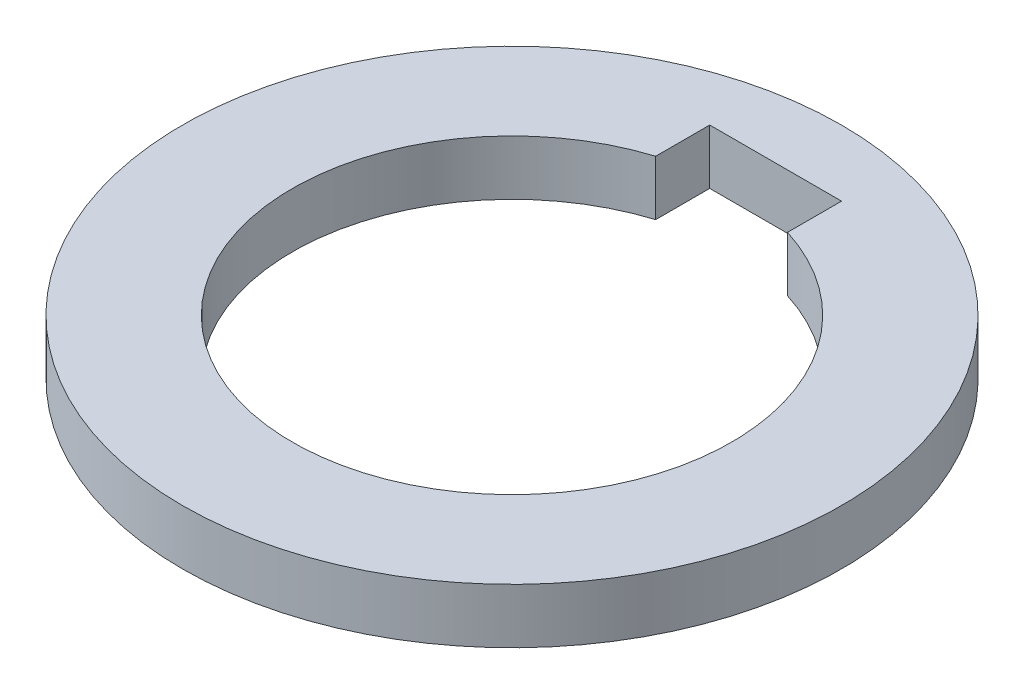
ISO-10303-21;
HEADER;
FILE_DESCRIPTION(('STEP AP214'),'2;1');
FILE_NAME('part.step','',(''),(''),'','','');
FILE_SCHEMA(('AUTOMOTIVE_DESIGN { 1 0 10303 214 1 1 1 1 }'));
ENDSEC;
DATA;
#1=APPLICATION_CONTEXT('core data for automotive mechanical design processes');
#2=APPLICATION_PROTOCOL_DEFINITION('international standard','automotive_design',2000,#1);
#3=PRODUCT_CONTEXT('',#1,'mechanical');
#4=PRODUCT('Part','Part','',(#3));
#5=PRODUCT_RELATED_PRODUCT_CATEGORY('part','',(#4));
#6=PRODUCT_DEFINITION_FORMATION('','',#4);
#7=PRODUCT_DEFINITION_CONTEXT('part definition',#1,'design');
#8=PRODUCT_DEFINITION('design','',#6,#7);
#9=PRODUCT_DEFINITION_SHAPE('','',#8);
#10=(LENGTH_UNIT() NAMED_UNIT(*) SI_UNIT(.MILLI.,.METRE.));
#11=(NAMED_UNIT(*) PLANE_ANGLE_UNIT() SI_UNIT($,.RADIAN.));
#12=(NAMED_UNIT(*) SI_UNIT($,.STERADIAN.) SOLID_ANGLE_UNIT());
#13=UNCERTAINTY_MEASURE_WITH_UNIT(LENGTH_MEASURE(1.E-05),#10,'distance_accuracy_value','');
#14=(GEOMETRIC_REPRESENTATION_CONTEXT(3) GLOBAL_UNCERTAINTY_ASSIGNED_CONTEXT((#13)) GLOBAL_UNIT_ASSIGNED_CONTEXT((#10,
#11,#12)) REPRESENTATION_CONTEXT('',''));
#15=CARTESIAN_POINT('',(0.,0.,0.));
#16=DIRECTION('',(0.,0.,1.));
#17=DIRECTION('',(1.,0.,0.));
#18=AXIS2_PLACEMENT_3D('',#15,#16,#17);
#19=CARTESIAN_POINT('',(0.,5.,0.));
#20=DIRECTION('',(0.,1.,0.));
#21=DIRECTION('',(0.,0.,1.));
#22=AXIS2_PLACEMENT_3D('',#19,#20,#21);
#23=PLANE('',#22);
#24=CARTESIAN_POINT('',(0.,5.,0.));
#25=DIRECTION('',(0.,1.,0.));
#26=DIRECTION('',(0.,0.,1.));
#27=AXIS2_PLACEMENT_3D('',#24,#25,#26);
#28=CIRCLE('',#27,30.);
#29=CARTESIAN_POINT('',(0.,5.,30.));
#30=VERTEX_POINT('',#29);
#31=EDGE_CURVE('E11',#30,#30,#28,.T.);
#32=ORIENTED_EDGE('',*,*,#31,.T.);
#33=EDGE_LOOP('',(#32));
#34=FACE_BOUND('',#33,.T.);
#35=DIRECTION('',(-1.,0.,0.));
#36=VECTOR('',#35,1.);
#37=CARTESIAN_POINT('',(0.,5.,-24.));
#38=LINE('',#37,#36);
#39=CARTESIAN_POINT('',(6.,5.,-24.));
#40=VERTEX_POINT('',#39);
#41=CARTESIAN_POINT('',(-6.,5.,-24.));
#42=VERTEX_POINT('',#41);
#43=EDGE_CURVE('E59',#40,#42,#38,.T.);
#44=ORIENTED_EDGE('',*,*,#43,.F.);
#45=DIRECTION('',(0.,0.,-1.));
#46=VECTOR('',#45,1.);
#47=CARTESIAN_POINT('',(6.,5.,0.));
#48=LINE('',#47,#46);
#49=CARTESIAN_POINT('',(6.,5.,-19.0787840283389));
#50=VERTEX_POINT('',#49);
#51=EDGE_CURVE('E82',#50,#40,#48,.T.);
#52=ORIENTED_EDGE('',*,*,#51,.F.);
#53=CARTESIAN_POINT('',(0.,5.,0.));
#54=DIRECTION('',(0.,1.,0.));
#55=DIRECTION('',(0.,0.,1.));
#56=AXIS2_PLACEMENT_3D('',#53,#54,#55);
#57=CIRCLE('',#56,20.);
#58=CARTESIAN_POINT('',(-6.,5.,-19.0787840283389));
#59=VERTEX_POINT('',#58);
#60=EDGE_CURVE('E94',#59,#50,#57,.T.);
#61=ORIENTED_EDGE('',*,*,#60,.F.);
#62=DIRECTION('',(0.,0.,-1.));
#63=VECTOR('',#62,1.);
#64=CARTESIAN_POINT('',(-6.,5.,0.));
#65=LINE('',#64,#63);
#66=EDGE_CURVE('E50',#59,#42,#65,.T.);
#67=ORIENTED_EDGE('',*,*,#66,.T.);
#68=EDGE_LOOP('',(#44,#52,#61,#67));
#69=FACE_BOUND('',#68,.T.);
#70=ADVANCED_FACE('F35',(#34,#69),#23,.T.);
#71=CARTESIAN_POINT('',(0.,0.,0.));
#72=DIRECTION('',(0.,1.,0.));
#73=DIRECTION('',(0.,0.,1.));
#74=AXIS2_PLACEMENT_3D('',#71,#72,#73);
#75=PLANE('',#74);
#76=CARTESIAN_POINT('',(0.,0.,0.));
#77=DIRECTION('',(0.,1.,0.));
#78=DIRECTION('',(0.,0.,1.));
#79=AXIS2_PLACEMENT_3D('',#76,#77,#78);
#80=CIRCLE('',#79,30.);
#81=CARTESIAN_POINT('',(0.,0.,30.));
#82=VERTEX_POINT('',#81);
#83=EDGE_CURVE('E39',#82,#82,#80,.T.);
#84=ORIENTED_EDGE('',*,*,#83,.F.);
#85=EDGE_LOOP('',(#84));
#86=FACE_BOUND('',#85,.T.);
#87=DIRECTION('',(0.,0.,-1.));
#88=VECTOR('',#87,1.);
#89=CARTESIAN_POINT('',(6.,0.,0.));
#90=LINE('',#89,#88);
#91=CARTESIAN_POINT('',(6.,0.,-19.0787840283389));
#92=VERTEX_POINT('',#91);
#93=CARTESIAN_POINT('',(6.,0.,-24.));
#94=VERTEX_POINT('',#93);
#95=EDGE_CURVE('E84',#92,#94,#90,.T.);
#96=ORIENTED_EDGE('',*,*,#95,.T.);
#97=DIRECTION('',(-1.,0.,0.));
#98=VECTOR('',#97,1.);
#99=CARTESIAN_POINT('',(0.,0.,-24.));
#100=LINE('',#99,#98);
#101=CARTESIAN_POINT('',(-6.,0.,-24.));
#102=VERTEX_POINT('',#101);
#103=EDGE_CURVE('E107',#94,#102,#100,.T.);
#104=ORIENTED_EDGE('',*,*,#103,.T.);
#105=DIRECTION('',(0.,0.,-1.));
#106=VECTOR('',#105,1.);
#107=CARTESIAN_POINT('',(-6.,0.,0.));
#108=LINE('',#107,#106);
#109=CARTESIAN_POINT('',(-6.,0.,-19.0787840283389));
#110=VERTEX_POINT('',#109);
#111=EDGE_CURVE('E95',#110,#102,#108,.T.);
#112=ORIENTED_EDGE('',*,*,#111,.F.);
#113=CARTESIAN_POINT('',(0.,0.,0.));
#114=DIRECTION('',(0.,1.,0.));
#115=DIRECTION('',(0.,0.,1.));
#116=AXIS2_PLACEMENT_3D('',#113,#114,#115);
#117=CIRCLE('',#116,20.);
#118=EDGE_CURVE('E89',#110,#92,#117,.T.);
#119=ORIENTED_EDGE('',*,*,#118,.T.);
#120=EDGE_LOOP('',(#96,#104,#112,#119));
#121=FACE_BOUND('',#120,.T.);
#122=ADVANCED_FACE('F113',(#86,#121),#75,.F.);
#123=CARTESIAN_POINT('',(0.,5.,0.));
#124=DIRECTION('',(0.,-1.,0.));
#125=DIRECTION('',(0.,0.,-1.));
#126=AXIS2_PLACEMENT_3D('',#123,#124,#125);
#127=CYLINDRICAL_SURFACE('',#126,20.);
#128=ORIENTED_EDGE('',*,*,#60,.T.);
#129=DIRECTION('',(0.,-1.,0.));
#130=VECTOR('',#129,1.);
#131=CARTESIAN_POINT('',(6.,5.,-19.0787840283389));
#132=LINE('',#131,#130);
#133=EDGE_CURVE('E79',#50,#92,#132,.T.);
#134=ORIENTED_EDGE('',*,*,#133,.T.);
#135=ORIENTED_EDGE('',*,*,#118,.F.);
#136=DIRECTION('',(0.,-1.,0.));
#137=VECTOR('',#136,1.);
#138=CARTESIAN_POINT('',(-6.,5.,-19.0787840283389));
#139=LINE('',#138,#137);
#140=EDGE_CURVE('E74',#59,#110,#139,.T.);
#141=ORIENTED_EDGE('',*,*,#140,.F.);
#142=EDGE_LOOP('',(#128,#134,#135,#141));
#143=FACE_BOUND('',#142,.T.);
#144=ADVANCED_FACE('F97',(#143),#127,.F.);
#145=CARTESIAN_POINT('',(0.,5.,0.));
#146=DIRECTION('',(0.,-1.,0.));
#147=DIRECTION('',(0.,0.,-1.));
#148=AXIS2_PLACEMENT_3D('',#145,#146,#147);
#149=CYLINDRICAL_SURFACE('',#148,30.);
#150=ORIENTED_EDGE('',*,*,#31,.F.);
#151=EDGE_LOOP('',(#150));
#152=FACE_BOUND('',#151,.T.);
#153=ORIENTED_EDGE('',*,*,#83,.T.);
#154=EDGE_LOOP('',(#153));
#155=FACE_BOUND('',#154,.T.);
#156=ADVANCED_FACE('F37',(#152,#155),#149,.T.);
#157=CARTESIAN_POINT('',(6.,5.,0.));
#158=DIRECTION('',(-1.,0.,0.));
#159=DIRECTION('',(0.,0.,1.));
#160=AXIS2_PLACEMENT_3D('',#157,#158,#159);
#161=PLANE('',#160);
#162=ORIENTED_EDGE('',*,*,#95,.F.);
#163=ORIENTED_EDGE('',*,*,#133,.F.);
#164=ORIENTED_EDGE('',*,*,#51,.T.);
#165=DIRECTION('',(0.,-1.,0.));
#166=VECTOR('',#165,1.);
#167=CARTESIAN_POINT('',(6.,5.,-24.));
#168=LINE('',#167,#166);
#169=EDGE_CURVE('E90',#40,#94,#168,.T.);
#170=ORIENTED_EDGE('',*,*,#169,.T.);
#171=EDGE_LOOP('',(#162,#163,#164,#170));
#172=FACE_BOUND('',#171,.T.);
#173=ADVANCED_FACE('F81',(#172),#161,.T.);
#174=CARTESIAN_POINT('',(0.,5.,-24.));
#175=DIRECTION('',(0.,0.,1.));
#176=DIRECTION('',(1.,0.,0.));
#177=AXIS2_PLACEMENT_3D('',#174,#175,#176);
#178=PLANE('',#177);
#179=ORIENTED_EDGE('',*,*,#103,.F.);
#180=ORIENTED_EDGE('',*,*,#169,.F.);
#181=ORIENTED_EDGE('',*,*,#43,.T.);
#182=DIRECTION('',(0.,-1.,0.));
#183=VECTOR('',#182,1.);
#184=CARTESIAN_POINT('',(-6.,5.,-24.));
#185=LINE('',#184,#183);
#186=EDGE_CURVE('E103',#42,#102,#185,.T.);
#187=ORIENTED_EDGE('',*,*,#186,.T.);
#188=EDGE_LOOP('',(#179,#180,#181,#187));
#189=FACE_BOUND('',#188,.T.);
#190=ADVANCED_FACE('F116',(#189),#178,.T.);
#191=CARTESIAN_POINT('',(-6.,5.,0.));
#192=DIRECTION('',(-1.,0.,0.));
#193=DIRECTION('',(0.,0.,1.));
#194=AXIS2_PLACEMENT_3D('',#191,#192,#193);
#195=PLANE('',#194);
#196=ORIENTED_EDGE('',*,*,#111,.T.);
#197=ORIENTED_EDGE('',*,*,#186,.F.);
#198=ORIENTED_EDGE('',*,*,#66,.F.);
#199=ORIENTED_EDGE('',*,*,#140,.T.);
#200=EDGE_LOOP('',(#196,#197,#198,#199));
#201=FACE_BOUND('',#200,.T.);
#202=ADVANCED_FACE('F115',(#201),#195,.F.);
#203=CLOSED_SHELL('',(#70,#122,#144,#156,#173,#190,#202));
#204=MANIFOLD_SOLID_BREP('B2',#203);
#205=ADVANCED_BREP_SHAPE_REPRESENTATION('',(#18,#204),#14);
#206=SHAPE_DEFINITION_REPRESENTATION(#9,#205);
ENDSEC;
END-ISO-10303-21;
